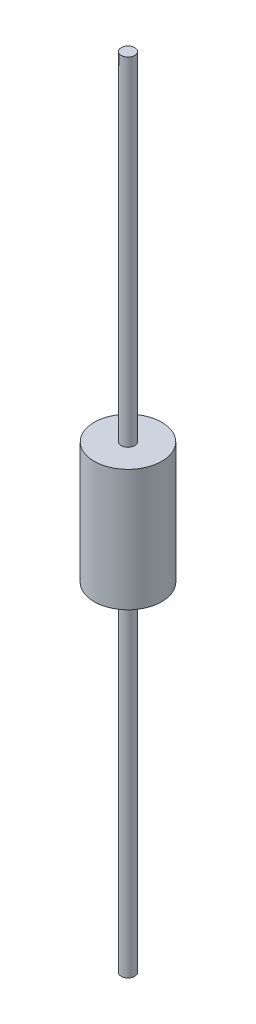
ISO-10303-21;
HEADER;
FILE_DESCRIPTION(('STEP AP214'),'2;1');
FILE_NAME('part.step','',(''),(''),'','','');
FILE_SCHEMA(('AUTOMOTIVE_DESIGN { 1 0 10303 214 1 1 1 1 }'));
ENDSEC;
DATA;
#1=APPLICATION_CONTEXT('core data for automotive mechanical design processes');
#2=APPLICATION_PROTOCOL_DEFINITION('international standard','automotive_design',2000,#1);
#3=PRODUCT_CONTEXT('',#1,'mechanical');
#4=PRODUCT('Part','Part','',(#3));
#5=PRODUCT_RELATED_PRODUCT_CATEGORY('part','',(#4));
#6=PRODUCT_DEFINITION_FORMATION('','',#4);
#7=PRODUCT_DEFINITION_CONTEXT('part definition',#1,'design');
#8=PRODUCT_DEFINITION('design','',#6,#7);
#9=PRODUCT_DEFINITION_SHAPE('','',#8);
#10=(LENGTH_UNIT() NAMED_UNIT(*) SI_UNIT(.MILLI.,.METRE.));
#11=(NAMED_UNIT(*) PLANE_ANGLE_UNIT() SI_UNIT($,.RADIAN.));
#12=(NAMED_UNIT(*) SI_UNIT($,.STERADIAN.) SOLID_ANGLE_UNIT());
#13=UNCERTAINTY_MEASURE_WITH_UNIT(LENGTH_MEASURE(1.E-05),#10,'distance_accuracy_value','');
#14=(GEOMETRIC_REPRESENTATION_CONTEXT(3) GLOBAL_UNCERTAINTY_ASSIGNED_CONTEXT((#13)) GLOBAL_UNIT_ASSIGNED_CONTEXT((#10,
#11,#12)) REPRESENTATION_CONTEXT('',''));
#15=CARTESIAN_POINT('',(0.,0.,0.));
#16=DIRECTION('',(0.,0.,1.));
#17=DIRECTION('',(1.,0.,0.));
#18=AXIS2_PLACEMENT_3D('',#15,#16,#17);
#19=CARTESIAN_POINT('',(0.,4.5,0.));
#20=DIRECTION('',(0.,-1.,0.));
#21=DIRECTION('',(0.,0.,-1.));
#22=AXIS2_PLACEMENT_3D('',#19,#20,#21);
#23=CYLINDRICAL_SURFACE('',#22,2.5);
#24=CARTESIAN_POINT('',(0.,4.5,0.));
#25=DIRECTION('',(0.,1.,0.));
#26=DIRECTION('',(0.,0.,1.));
#27=AXIS2_PLACEMENT_3D('',#24,#25,#26);
#28=CIRCLE('',#27,2.5);
#29=CARTESIAN_POINT('',(0.,4.5,2.5));
#30=VERTEX_POINT('',#29);
#31=EDGE_CURVE('E39',#30,#30,#28,.T.);
#32=ORIENTED_EDGE('',*,*,#31,.F.);
#33=EDGE_LOOP('',(#32));
#34=FACE_BOUND('',#33,.T.);
#35=CARTESIAN_POINT('',(0.,-4.5,0.));
#36=DIRECTION('',(0.,1.,0.));
#37=DIRECTION('',(0.,0.,1.));
#38=AXIS2_PLACEMENT_3D('',#35,#36,#37);
#39=CIRCLE('',#38,2.5);
#40=CARTESIAN_POINT('',(0.,-4.5,2.5));
#41=VERTEX_POINT('',#40);
#42=EDGE_CURVE('E35',#41,#41,#39,.T.);
#43=ORIENTED_EDGE('',*,*,#42,.T.);
#44=EDGE_LOOP('',(#43));
#45=FACE_BOUND('',#44,.T.);
#46=ADVANCED_FACE('F32',(#34,#45),#23,.T.);
#47=CARTESIAN_POINT('',(0.,4.5,0.));
#48=DIRECTION('',(0.,1.,0.));
#49=DIRECTION('',(0.,0.,1.));
#50=AXIS2_PLACEMENT_3D('',#47,#48,#49);
#51=PLANE('',#50);
#52=CARTESIAN_POINT('',(0.,4.5,0.));
#53=DIRECTION('',(0.,1.,0.));
#54=DIRECTION('',(0.,0.,1.));
#55=AXIS2_PLACEMENT_3D('',#52,#53,#54);
#56=CIRCLE('',#55,0.5);
#57=CARTESIAN_POINT('',(0.,4.5,0.5));
#58=VERTEX_POINT('',#57);
#59=EDGE_CURVE('E10',#58,#58,#56,.T.);
#60=ORIENTED_EDGE('',*,*,#59,.F.);
#61=EDGE_LOOP('',(#60));
#62=FACE_BOUND('',#61,.T.);
#63=ORIENTED_EDGE('',*,*,#31,.T.);
#64=EDGE_LOOP('',(#63));
#65=FACE_BOUND('',#64,.T.);
#66=ADVANCED_FACE('F67',(#62,#65),#51,.T.);
#67=CARTESIAN_POINT('',(0.,-4.5,0.));
#68=DIRECTION('',(0.,1.,0.));
#69=DIRECTION('',(0.,0.,1.));
#70=AXIS2_PLACEMENT_3D('',#67,#68,#69);
#71=PLANE('',#70);
#72=CARTESIAN_POINT('',(0.,-4.5,0.));
#73=DIRECTION('',(0.,1.,0.));
#74=DIRECTION('',(0.,0.,1.));
#75=AXIS2_PLACEMENT_3D('',#72,#73,#74);
#76=CIRCLE('',#75,0.5);
#77=CARTESIAN_POINT('',(0.,-4.5,0.5));
#78=VERTEX_POINT('',#77);
#79=EDGE_CURVE('E49',#78,#78,#76,.T.);
#80=ORIENTED_EDGE('',*,*,#79,.T.);
#81=EDGE_LOOP('',(#80));
#82=FACE_BOUND('',#81,.T.);
#83=ORIENTED_EDGE('',*,*,#42,.F.);
#84=EDGE_LOOP('',(#83));
#85=FACE_BOUND('',#84,.T.);
#86=ADVANCED_FACE('F72',(#82,#85),#71,.F.);
#87=CARTESIAN_POINT('',(0.,29.5,0.));
#88=DIRECTION('',(0.,-1.,0.));
#89=DIRECTION('',(0.,0.,-1.));
#90=AXIS2_PLACEMENT_3D('',#87,#88,#89);
#91=CYLINDRICAL_SURFACE('',#90,0.5);
#92=CARTESIAN_POINT('',(0.,29.5,0.));
#93=DIRECTION('',(0.,1.,0.));
#94=DIRECTION('',(0.,0.,1.));
#95=AXIS2_PLACEMENT_3D('',#92,#93,#94);
#96=CIRCLE('',#95,0.5);
#97=CARTESIAN_POINT('',(0.,29.5,0.5));
#98=VERTEX_POINT('',#97);
#99=EDGE_CURVE('E45',#98,#98,#96,.T.);
#100=ORIENTED_EDGE('',*,*,#99,.F.);
#101=EDGE_LOOP('',(#100));
#102=FACE_BOUND('',#101,.T.);
#103=ORIENTED_EDGE('',*,*,#59,.T.);
#104=EDGE_LOOP('',(#103));
#105=FACE_BOUND('',#104,.T.);
#106=ADVANCED_FACE('F81',(#102,#105),#91,.T.);
#107=CARTESIAN_POINT('',(0.,29.5,0.));
#108=DIRECTION('',(0.,1.,0.));
#109=DIRECTION('',(0.,0.,1.));
#110=AXIS2_PLACEMENT_3D('',#107,#108,#109);
#111=PLANE('',#110);
#112=ORIENTED_EDGE('',*,*,#99,.T.);
#113=EDGE_LOOP('',(#112));
#114=FACE_BOUND('',#113,.T.);
#115=ADVANCED_FACE('F64',(#114),#111,.T.);
#116=CARTESIAN_POINT('',(0.,-29.5,0.));
#117=DIRECTION('',(0.,1.,0.));
#118=DIRECTION('',(0.,0.,1.));
#119=AXIS2_PLACEMENT_3D('',#116,#117,#118);
#120=CYLINDRICAL_SURFACE('',#119,0.5);
#121=CARTESIAN_POINT('',(0.,-29.5,0.));
#122=DIRECTION('',(0.,1.,0.));
#123=DIRECTION('',(0.,0.,1.));
#124=AXIS2_PLACEMENT_3D('',#121,#122,#123);
#125=CIRCLE('',#124,0.5);
#126=CARTESIAN_POINT('',(0.,-29.5,0.5));
#127=VERTEX_POINT('',#126);
#128=EDGE_CURVE('E48',#127,#127,#125,.T.);
#129=ORIENTED_EDGE('',*,*,#128,.T.);
#130=EDGE_LOOP('',(#129));
#131=FACE_BOUND('',#130,.T.);
#132=ORIENTED_EDGE('',*,*,#79,.F.);
#133=EDGE_LOOP('',(#132));
#134=FACE_BOUND('',#133,.T.);
#135=ADVANCED_FACE('F55',(#131,#134),#120,.T.);
#136=CARTESIAN_POINT('',(0.,-29.5,0.));
#137=DIRECTION('',(0.,-1.,0.));
#138=DIRECTION('',(0.,0.,1.));
#139=AXIS2_PLACEMENT_3D('',#136,#137,#138);
#140=PLANE('',#139);
#141=ORIENTED_EDGE('',*,*,#128,.F.);
#142=EDGE_LOOP('',(#141));
#143=FACE_BOUND('',#142,.T.);
#144=ADVANCED_FACE('F58',(#143),#140,.T.);
#145=CLOSED_SHELL('',(#46,#66,#86,#106,#115,#135,#144));
#146=MANIFOLD_SOLID_BREP('B2',#145);
#147=ADVANCED_BREP_SHAPE_REPRESENTATION('',(#18,#146),#14);
#148=SHAPE_DEFINITION_REPRESENTATION(#9,#147);
ENDSEC;
END-ISO-10303-21;
